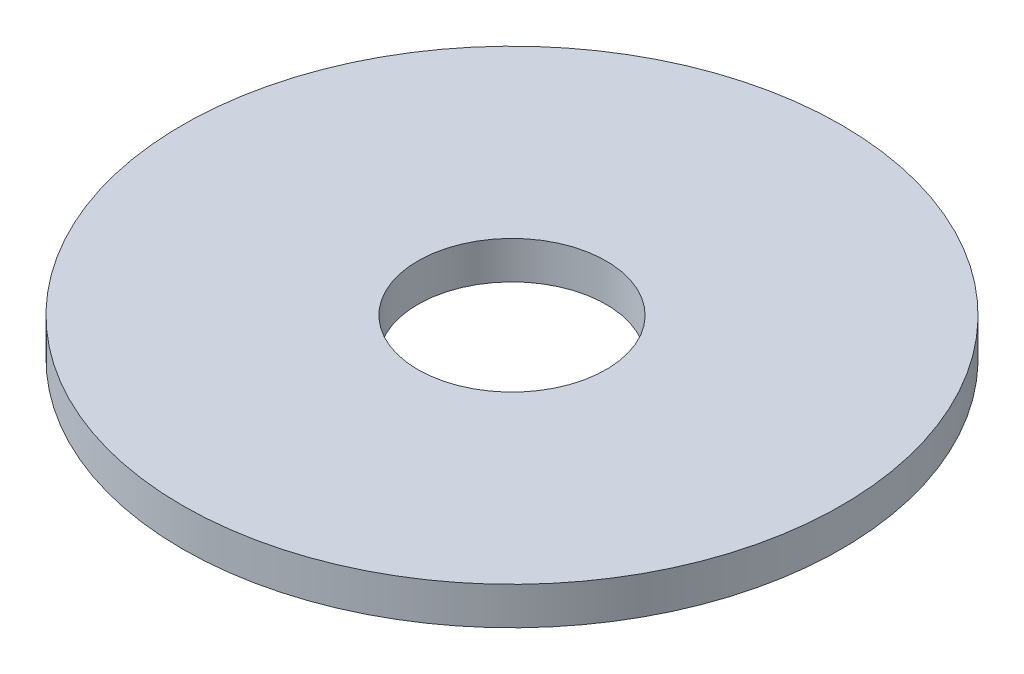
ISO-10303-21;
HEADER;
FILE_DESCRIPTION(('STEP AP214'),'2;1');
FILE_NAME('part.step','',(''),(''),'','','');
FILE_SCHEMA(('AUTOMOTIVE_DESIGN { 1 0 10303 214 1 1 1 1 }'));
ENDSEC;
DATA;
#1=APPLICATION_CONTEXT('core data for automotive mechanical design processes');
#2=APPLICATION_PROTOCOL_DEFINITION('international standard','automotive_design',2000,#1);
#3=PRODUCT_CONTEXT('',#1,'mechanical');
#4=PRODUCT('Part','Part','',(#3));
#5=PRODUCT_RELATED_PRODUCT_CATEGORY('part','',(#4));
#6=PRODUCT_DEFINITION_FORMATION('','',#4);
#7=PRODUCT_DEFINITION_CONTEXT('part definition',#1,'design');
#8=PRODUCT_DEFINITION('design','',#6,#7);
#9=PRODUCT_DEFINITION_SHAPE('','',#8);
#10=(LENGTH_UNIT() NAMED_UNIT(*) SI_UNIT(.MILLI.,.METRE.));
#11=(NAMED_UNIT(*) PLANE_ANGLE_UNIT() SI_UNIT($,.RADIAN.));
#12=(NAMED_UNIT(*) SI_UNIT($,.STERADIAN.) SOLID_ANGLE_UNIT());
#13=UNCERTAINTY_MEASURE_WITH_UNIT(LENGTH_MEASURE(1.E-05),#10,'distance_accuracy_value','');
#14=(GEOMETRIC_REPRESENTATION_CONTEXT(3) GLOBAL_UNCERTAINTY_ASSIGNED_CONTEXT((#13)) GLOBAL_UNIT_ASSIGNED_CONTEXT((#10,
#11,#12)) REPRESENTATION_CONTEXT('',''));
#15=CARTESIAN_POINT('',(0.,0.,0.));
#16=DIRECTION('',(0.,0.,1.));
#17=DIRECTION('',(1.,0.,0.));
#18=AXIS2_PLACEMENT_3D('',#15,#16,#17);
#19=CARTESIAN_POINT('',(0.,6.,0.));
#20=DIRECTION('',(0.,-1.,0.));
#21=DIRECTION('',(0.,0.,-1.));
#22=AXIS2_PLACEMENT_3D('',#19,#20,#21);
#23=CYLINDRICAL_SURFACE('',#22,52.5);
#24=CARTESIAN_POINT('',(0.,6.,0.));
#25=DIRECTION('',(0.,1.,0.));
#26=DIRECTION('',(0.,0.,1.));
#27=AXIS2_PLACEMENT_3D('',#24,#25,#26);
#28=CIRCLE('',#27,52.5);
#29=CARTESIAN_POINT('',(0.,6.,52.5));
#30=VERTEX_POINT('',#29);
#31=EDGE_CURVE('E10',#30,#30,#28,.T.);
#32=ORIENTED_EDGE('',*,*,#31,.F.);
#33=EDGE_LOOP('',(#32));
#34=FACE_BOUND('',#33,.T.);
#35=CARTESIAN_POINT('',(0.,0.,0.));
#36=DIRECTION('',(0.,1.,0.));
#37=DIRECTION('',(0.,0.,1.));
#38=AXIS2_PLACEMENT_3D('',#35,#36,#37);
#39=CIRCLE('',#38,52.5);
#40=CARTESIAN_POINT('',(0.,0.,52.5));
#41=VERTEX_POINT('',#40);
#42=EDGE_CURVE('E37',#41,#41,#39,.T.);
#43=ORIENTED_EDGE('',*,*,#42,.T.);
#44=EDGE_LOOP('',(#43));
#45=FACE_BOUND('',#44,.T.);
#46=ADVANCED_FACE('F40',(#34,#45),#23,.T.);
#47=CARTESIAN_POINT('',(0.,6.,0.));
#48=DIRECTION('',(0.,1.,0.));
#49=DIRECTION('',(0.,0.,1.));
#50=AXIS2_PLACEMENT_3D('',#47,#48,#49);
#51=PLANE('',#50);
#52=CARTESIAN_POINT('',(0.,6.,0.));
#53=DIRECTION('',(0.,1.,0.));
#54=DIRECTION('',(0.,0.,1.));
#55=AXIS2_PLACEMENT_3D('',#52,#53,#54);
#56=CIRCLE('',#55,15.);
#57=CARTESIAN_POINT('',(0.,6.,15.));
#58=VERTEX_POINT('',#57);
#59=EDGE_CURVE('E50',#58,#58,#56,.T.);
#60=ORIENTED_EDGE('',*,*,#59,.F.);
#61=EDGE_LOOP('',(#60));
#62=FACE_BOUND('',#61,.T.);
#63=ORIENTED_EDGE('',*,*,#31,.T.);
#64=EDGE_LOOP('',(#63));
#65=FACE_BOUND('',#64,.T.);
#66=ADVANCED_FACE('F59',(#62,#65),#51,.T.);
#67=CARTESIAN_POINT('',(0.,0.,0.));
#68=DIRECTION('',(0.,1.,0.));
#69=DIRECTION('',(0.,0.,1.));
#70=AXIS2_PLACEMENT_3D('',#67,#68,#69);
#71=PLANE('',#70);
#72=CARTESIAN_POINT('',(0.,0.,0.));
#73=DIRECTION('',(0.,1.,0.));
#74=DIRECTION('',(0.,0.,1.));
#75=AXIS2_PLACEMENT_3D('',#72,#73,#74);
#76=CIRCLE('',#75,15.);
#77=CARTESIAN_POINT('',(0.,0.,15.));
#78=VERTEX_POINT('',#77);
#79=EDGE_CURVE('E47',#78,#78,#76,.T.);
#80=ORIENTED_EDGE('',*,*,#79,.T.);
#81=EDGE_LOOP('',(#80));
#82=FACE_BOUND('',#81,.T.);
#83=ORIENTED_EDGE('',*,*,#42,.F.);
#84=EDGE_LOOP('',(#83));
#85=FACE_BOUND('',#84,.T.);
#86=ADVANCED_FACE('F58',(#82,#85),#71,.F.);
#87=CARTESIAN_POINT('',(0.,6.,0.));
#88=DIRECTION('',(0.,-1.,0.));
#89=DIRECTION('',(0.,0.,-1.));
#90=AXIS2_PLACEMENT_3D('',#87,#88,#89);
#91=CYLINDRICAL_SURFACE('',#90,15.);
#92=ORIENTED_EDGE('',*,*,#59,.T.);
#93=EDGE_LOOP('',(#92));
#94=FACE_BOUND('',#93,.T.);
#95=ORIENTED_EDGE('',*,*,#79,.F.);
#96=EDGE_LOOP('',(#95));
#97=FACE_BOUND('',#96,.T.);
#98=ADVANCED_FACE('F54',(#94,#97),#91,.F.);
#99=CLOSED_SHELL('',(#46,#66,#86,#98));
#100=MANIFOLD_SOLID_BREP('B2',#99);
#101=ADVANCED_BREP_SHAPE_REPRESENTATION('',(#18,#100),#14);
#102=SHAPE_DEFINITION_REPRESENTATION(#9,#101);
ENDSEC;
END-ISO-10303-21;
